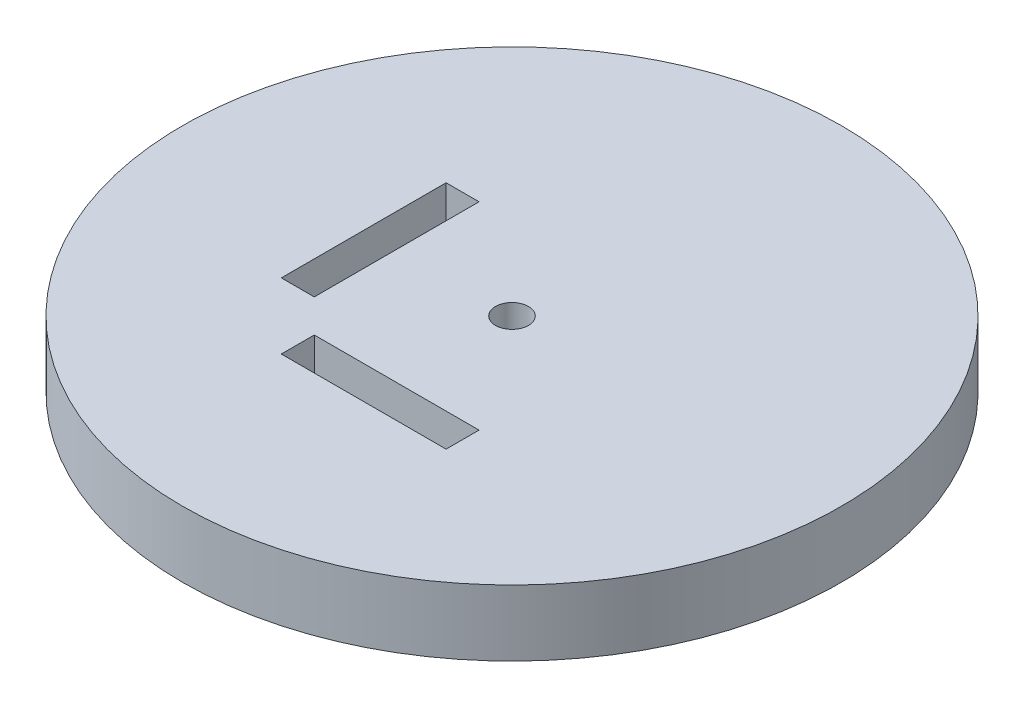
ISO-10303-21;
HEADER;
FILE_DESCRIPTION(('STEP AP214'),'2;1');
FILE_NAME('part.step','',(''),(''),'','','');
FILE_SCHEMA(('AUTOMOTIVE_DESIGN { 1 0 10303 214 1 1 1 1 }'));
ENDSEC;
DATA;
#1=APPLICATION_CONTEXT('core data for automotive mechanical design processes');
#2=APPLICATION_PROTOCOL_DEFINITION('international standard','automotive_design',2000,#1);
#3=PRODUCT_CONTEXT('',#1,'mechanical');
#4=PRODUCT('Part','Part','',(#3));
#5=PRODUCT_RELATED_PRODUCT_CATEGORY('part','',(#4));
#6=PRODUCT_DEFINITION_FORMATION('','',#4);
#7=PRODUCT_DEFINITION_CONTEXT('part definition',#1,'design');
#8=PRODUCT_DEFINITION('design','',#6,#7);
#9=PRODUCT_DEFINITION_SHAPE('','',#8);
#10=(LENGTH_UNIT() NAMED_UNIT(*) SI_UNIT(.MILLI.,.METRE.));
#11=(NAMED_UNIT(*) PLANE_ANGLE_UNIT() SI_UNIT($,.RADIAN.));
#12=(NAMED_UNIT(*) SI_UNIT($,.STERADIAN.) SOLID_ANGLE_UNIT());
#13=UNCERTAINTY_MEASURE_WITH_UNIT(LENGTH_MEASURE(1.E-05),#10,'distance_accuracy_value','');
#14=(GEOMETRIC_REPRESENTATION_CONTEXT(3) GLOBAL_UNCERTAINTY_ASSIGNED_CONTEXT((#13)) GLOBAL_UNIT_ASSIGNED_CONTEXT((#10,
#11,#12)) REPRESENTATION_CONTEXT('',''));
#15=CARTESIAN_POINT('',(0.,0.,0.));
#16=DIRECTION('',(0.,0.,1.));
#17=DIRECTION('',(1.,0.,0.));
#18=AXIS2_PLACEMENT_3D('',#15,#16,#17);
#19=CARTESIAN_POINT('',(0.,10.,0.));
#20=DIRECTION('',(0.,-1.,0.));
#21=DIRECTION('',(0.,0.,-1.));
#22=AXIS2_PLACEMENT_3D('',#19,#20,#21);
#23=CYLINDRICAL_SURFACE('',#22,50.);
#24=CARTESIAN_POINT('',(0.,10.,0.));
#25=DIRECTION('',(0.,1.,0.));
#26=DIRECTION('',(0.,0.,1.));
#27=AXIS2_PLACEMENT_3D('',#24,#25,#26);
#28=CIRCLE('',#27,50.);
#29=CARTESIAN_POINT('',(0.,10.,50.));
#30=VERTEX_POINT('',#29);
#31=EDGE_CURVE('E11',#30,#30,#28,.T.);
#32=ORIENTED_EDGE('',*,*,#31,.F.);
#33=EDGE_LOOP('',(#32));
#34=FACE_BOUND('',#33,.T.);
#35=CARTESIAN_POINT('',(0.,0.,0.));
#36=DIRECTION('',(0.,1.,0.));
#37=DIRECTION('',(0.,0.,1.));
#38=AXIS2_PLACEMENT_3D('',#35,#36,#37);
#39=CIRCLE('',#38,50.);
#40=CARTESIAN_POINT('',(0.,0.,50.));
#41=VERTEX_POINT('',#40);
#42=EDGE_CURVE('E36',#41,#41,#39,.T.);
#43=ORIENTED_EDGE('',*,*,#42,.T.);
#44=EDGE_LOOP('',(#43));
#45=FACE_BOUND('',#44,.T.);
#46=ADVANCED_FACE('F33',(#34,#45),#23,.T.);
#47=CARTESIAN_POINT('',(0.,10.,0.));
#48=DIRECTION('',(0.,1.,0.));
#49=DIRECTION('',(0.,0.,1.));
#50=AXIS2_PLACEMENT_3D('',#47,#48,#49);
#51=PLANE('',#50);
#52=DIRECTION('',(0.,0.,1.));
#53=VECTOR('',#52,1.);
#54=CARTESIAN_POINT('',(-22.5,10.,12.4999999999999));
#55=LINE('',#54,#53);
#56=CARTESIAN_POINT('',(-22.5,10.,-12.5000000000001));
#57=VERTEX_POINT('',#56);
#58=CARTESIAN_POINT('',(-22.5,10.,12.4999999999999));
#59=VERTEX_POINT('',#58);
#60=EDGE_CURVE('E47',#57,#59,#55,.T.);
#61=ORIENTED_EDGE('',*,*,#60,.F.);
#62=DIRECTION('',(-1.,0.,0.));
#63=VECTOR('',#62,1.);
#64=CARTESIAN_POINT('',(-17.5,10.,-12.5000000000001));
#65=LINE('',#64,#63);
#66=CARTESIAN_POINT('',(-17.5,10.,-12.5000000000001));
#67=VERTEX_POINT('',#66);
#68=EDGE_CURVE('E142',#67,#57,#65,.T.);
#69=ORIENTED_EDGE('',*,*,#68,.F.);
#70=DIRECTION('',(0.,0.,-1.));
#71=VECTOR('',#70,1.);
#72=CARTESIAN_POINT('',(-17.5,10.,12.4999999999999));
#73=LINE('',#72,#71);
#74=CARTESIAN_POINT('',(-17.5,10.,12.4999999999999));
#75=VERTEX_POINT('',#74);
#76=EDGE_CURVE('E156',#75,#67,#73,.T.);
#77=ORIENTED_EDGE('',*,*,#76,.F.);
#78=DIRECTION('',(1.,0.,0.));
#79=VECTOR('',#78,1.);
#80=CARTESIAN_POINT('',(-17.5,10.,12.4999999999999));
#81=LINE('',#80,#79);
#82=EDGE_CURVE('E153',#59,#75,#81,.T.);
#83=ORIENTED_EDGE('',*,*,#82,.F.);
#84=EDGE_LOOP('',(#61,#69,#77,#83));
#85=FACE_BOUND('',#84,.T.);
#86=DIRECTION('',(0.,0.,1.));
#87=VECTOR('',#86,1.);
#88=CARTESIAN_POINT('',(-12.5,10.,17.5));
#89=LINE('',#88,#87);
#90=CARTESIAN_POINT('',(-12.5,10.,17.5));
#91=VERTEX_POINT('',#90);
#92=CARTESIAN_POINT('',(-12.5,10.,22.5));
#93=VERTEX_POINT('',#92);
#94=EDGE_CURVE('E55',#91,#93,#89,.T.);
#95=ORIENTED_EDGE('',*,*,#94,.F.);
#96=DIRECTION('',(-1.,0.,0.));
#97=VECTOR('',#96,1.);
#98=CARTESIAN_POINT('',(12.5,10.,17.5));
#99=LINE('',#98,#97);
#100=CARTESIAN_POINT('',(12.5,10.,17.5));
#101=VERTEX_POINT('',#100);
#102=EDGE_CURVE('E118',#101,#91,#99,.T.);
#103=ORIENTED_EDGE('',*,*,#102,.F.);
#104=DIRECTION('',(0.,0.,-1.));
#105=VECTOR('',#104,1.);
#106=CARTESIAN_POINT('',(12.5,10.,17.5));
#107=LINE('',#106,#105);
#108=CARTESIAN_POINT('',(12.5,10.,22.5));
#109=VERTEX_POINT('',#108);
#110=EDGE_CURVE('E121',#109,#101,#107,.T.);
#111=ORIENTED_EDGE('',*,*,#110,.F.);
#112=DIRECTION('',(1.,0.,0.));
#113=VECTOR('',#112,1.);
#114=CARTESIAN_POINT('',(12.5,10.,22.5));
#115=LINE('',#114,#113);
#116=EDGE_CURVE('E127',#93,#109,#115,.T.);
#117=ORIENTED_EDGE('',*,*,#116,.F.);
#118=EDGE_LOOP('',(#95,#103,#111,#117));
#119=FACE_BOUND('',#118,.T.);
#120=CARTESIAN_POINT('',(0.,10.,0.));
#121=DIRECTION('',(0.,1.,0.));
#122=DIRECTION('',(0.,0.,1.));
#123=AXIS2_PLACEMENT_3D('',#120,#121,#122);
#124=CIRCLE('',#123,2.5);
#125=CARTESIAN_POINT('',(0.,10.,2.5));
#126=VERTEX_POINT('',#125);
#127=EDGE_CURVE('E134',#126,#126,#124,.T.);
#128=ORIENTED_EDGE('',*,*,#127,.F.);
#129=EDGE_LOOP('',(#128));
#130=FACE_BOUND('',#129,.T.);
#131=ORIENTED_EDGE('',*,*,#31,.T.);
#132=EDGE_LOOP('',(#131));
#133=FACE_BOUND('',#132,.T.);
#134=ADVANCED_FACE('F175',(#85,#119,#130,#133),#51,.T.);
#135=CARTESIAN_POINT('',(0.,0.,0.));
#136=DIRECTION('',(0.,1.,0.));
#137=DIRECTION('',(0.,0.,1.));
#138=AXIS2_PLACEMENT_3D('',#135,#136,#137);
#139=PLANE('',#138);
#140=DIRECTION('',(-1.,0.,0.));
#141=VECTOR('',#140,1.);
#142=CARTESIAN_POINT('',(-17.5,0.,-12.5000000000001));
#143=LINE('',#142,#141);
#144=CARTESIAN_POINT('',(-17.5,0.,-12.5000000000001));
#145=VERTEX_POINT('',#144);
#146=CARTESIAN_POINT('',(-22.5,0.,-12.5000000000001));
#147=VERTEX_POINT('',#146);
#148=EDGE_CURVE('E148',#145,#147,#143,.T.);
#149=ORIENTED_EDGE('',*,*,#148,.T.);
#150=DIRECTION('',(0.,0.,1.));
#151=VECTOR('',#150,1.);
#152=CARTESIAN_POINT('',(-22.5,0.,12.4999999999999));
#153=LINE('',#152,#151);
#154=CARTESIAN_POINT('',(-22.5,0.,12.4999999999999));
#155=VERTEX_POINT('',#154);
#156=EDGE_CURVE('E138',#147,#155,#153,.T.);
#157=ORIENTED_EDGE('',*,*,#156,.T.);
#158=DIRECTION('',(1.,0.,0.));
#159=VECTOR('',#158,1.);
#160=CARTESIAN_POINT('',(-17.5,0.,12.4999999999999));
#161=LINE('',#160,#159);
#162=CARTESIAN_POINT('',(-17.5,0.,12.4999999999999));
#163=VERTEX_POINT('',#162);
#164=EDGE_CURVE('E141',#155,#163,#161,.T.);
#165=ORIENTED_EDGE('',*,*,#164,.T.);
#166=DIRECTION('',(0.,0.,-1.));
#167=VECTOR('',#166,1.);
#168=CARTESIAN_POINT('',(-17.5,0.,12.4999999999999));
#169=LINE('',#168,#167);
#170=EDGE_CURVE('E145',#163,#145,#169,.T.);
#171=ORIENTED_EDGE('',*,*,#170,.T.);
#172=EDGE_LOOP('',(#149,#157,#165,#171));
#173=FACE_BOUND('',#172,.T.);
#174=DIRECTION('',(-1.,0.,0.));
#175=VECTOR('',#174,1.);
#176=CARTESIAN_POINT('',(12.5,0.,17.5));
#177=LINE('',#176,#175);
#178=CARTESIAN_POINT('',(12.5,0.,17.5));
#179=VERTEX_POINT('',#178);
#180=CARTESIAN_POINT('',(-12.5,0.,17.5));
#181=VERTEX_POINT('',#180);
#182=EDGE_CURVE('E105',#179,#181,#177,.T.);
#183=ORIENTED_EDGE('',*,*,#182,.T.);
#184=DIRECTION('',(0.,0.,1.));
#185=VECTOR('',#184,1.);
#186=CARTESIAN_POINT('',(-12.5,0.,17.5));
#187=LINE('',#186,#185);
#188=CARTESIAN_POINT('',(-12.5,0.,22.5));
#189=VERTEX_POINT('',#188);
#190=EDGE_CURVE('E99',#181,#189,#187,.T.);
#191=ORIENTED_EDGE('',*,*,#190,.T.);
#192=DIRECTION('',(1.,0.,0.));
#193=VECTOR('',#192,1.);
#194=CARTESIAN_POINT('',(12.5,0.,22.5));
#195=LINE('',#194,#193);
#196=CARTESIAN_POINT('',(12.5,0.,22.5));
#197=VERTEX_POINT('',#196);
#198=EDGE_CURVE('E109',#189,#197,#195,.T.);
#199=ORIENTED_EDGE('',*,*,#198,.T.);
#200=DIRECTION('',(0.,0.,-1.));
#201=VECTOR('',#200,1.);
#202=CARTESIAN_POINT('',(12.5,0.,17.5));
#203=LINE('',#202,#201);
#204=EDGE_CURVE('E113',#197,#179,#203,.T.);
#205=ORIENTED_EDGE('',*,*,#204,.T.);
#206=EDGE_LOOP('',(#183,#191,#199,#205));
#207=FACE_BOUND('',#206,.T.);
#208=CARTESIAN_POINT('',(0.,0.,0.));
#209=DIRECTION('',(0.,1.,0.));
#210=DIRECTION('',(0.,0.,1.));
#211=AXIS2_PLACEMENT_3D('',#208,#209,#210);
#212=CIRCLE('',#211,2.5);
#213=CARTESIAN_POINT('',(0.,0.,2.5));
#214=VERTEX_POINT('',#213);
#215=EDGE_CURVE('E167',#214,#214,#212,.T.);
#216=ORIENTED_EDGE('',*,*,#215,.T.);
#217=EDGE_LOOP('',(#216));
#218=FACE_BOUND('',#217,.T.);
#219=ORIENTED_EDGE('',*,*,#42,.F.);
#220=EDGE_LOOP('',(#219));
#221=FACE_BOUND('',#220,.T.);
#222=ADVANCED_FACE('F115',(#173,#207,#218,#221),#139,.F.);
#223=CARTESIAN_POINT('',(0.,0.,0.));
#224=DIRECTION('',(0.,1.,0.));
#225=DIRECTION('',(0.,0.,1.));
#226=AXIS2_PLACEMENT_3D('',#223,#224,#225);
#227=CYLINDRICAL_SURFACE('',#226,2.5);
#228=ORIENTED_EDGE('',*,*,#215,.F.);
#229=EDGE_LOOP('',(#228));
#230=FACE_BOUND('',#229,.T.);
#231=ORIENTED_EDGE('',*,*,#127,.T.);
#232=EDGE_LOOP('',(#231));
#233=FACE_BOUND('',#232,.T.);
#234=ADVANCED_FACE('F173',(#230,#233),#227,.F.);
#235=CARTESIAN_POINT('',(-12.5,0.,17.5));
#236=DIRECTION('',(-1.,0.,0.));
#237=DIRECTION('',(0.,0.,1.));
#238=AXIS2_PLACEMENT_3D('',#235,#236,#237);
#239=PLANE('',#238);
#240=ORIENTED_EDGE('',*,*,#94,.T.);
#241=DIRECTION('',(0.,1.,0.));
#242=VECTOR('',#241,1.);
#243=CARTESIAN_POINT('',(-12.5,0.,22.5));
#244=LINE('',#243,#242);
#245=EDGE_CURVE('E95',#189,#93,#244,.T.);
#246=ORIENTED_EDGE('',*,*,#245,.F.);
#247=ORIENTED_EDGE('',*,*,#190,.F.);
#248=DIRECTION('',(0.,1.,0.));
#249=VECTOR('',#248,1.);
#250=CARTESIAN_POINT('',(-12.5,0.,17.5));
#251=LINE('',#250,#249);
#252=EDGE_CURVE('E132',#181,#91,#251,.T.);
#253=ORIENTED_EDGE('',*,*,#252,.T.);
#254=EDGE_LOOP('',(#240,#246,#247,#253));
#255=FACE_BOUND('',#254,.T.);
#256=ADVANCED_FACE('F97',(#255),#239,.F.);
#257=CARTESIAN_POINT('',(12.5,0.,17.5));
#258=DIRECTION('',(0.,0.,-1.));
#259=DIRECTION('',(-1.,0.,0.));
#260=AXIS2_PLACEMENT_3D('',#257,#258,#259);
#261=PLANE('',#260);
#262=ORIENTED_EDGE('',*,*,#102,.T.);
#263=ORIENTED_EDGE('',*,*,#252,.F.);
#264=ORIENTED_EDGE('',*,*,#182,.F.);
#265=DIRECTION('',(0.,1.,0.));
#266=VECTOR('',#265,1.);
#267=CARTESIAN_POINT('',(12.5,0.,17.5));
#268=LINE('',#267,#266);
#269=EDGE_CURVE('E135',#179,#101,#268,.T.);
#270=ORIENTED_EDGE('',*,*,#269,.T.);
#271=EDGE_LOOP('',(#262,#263,#264,#270));
#272=FACE_BOUND('',#271,.T.);
#273=ADVANCED_FACE('F212',(#272),#261,.F.);
#274=CARTESIAN_POINT('',(12.5,0.,17.5));
#275=DIRECTION('',(1.,0.,0.));
#276=DIRECTION('',(0.,0.,-1.));
#277=AXIS2_PLACEMENT_3D('',#274,#275,#276);
#278=PLANE('',#277);
#279=ORIENTED_EDGE('',*,*,#110,.T.);
#280=ORIENTED_EDGE('',*,*,#269,.F.);
#281=ORIENTED_EDGE('',*,*,#204,.F.);
#282=DIRECTION('',(0.,1.,0.));
#283=VECTOR('',#282,1.);
#284=CARTESIAN_POINT('',(12.5,0.,22.5));
#285=LINE('',#284,#283);
#286=EDGE_CURVE('E104',#197,#109,#285,.T.);
#287=ORIENTED_EDGE('',*,*,#286,.T.);
#288=EDGE_LOOP('',(#279,#280,#281,#287));
#289=FACE_BOUND('',#288,.T.);
#290=ADVANCED_FACE('F215',(#289),#278,.F.);
#291=CARTESIAN_POINT('',(12.5,0.,22.5));
#292=DIRECTION('',(0.,0.,1.));
#293=DIRECTION('',(1.,0.,0.));
#294=AXIS2_PLACEMENT_3D('',#291,#292,#293);
#295=PLANE('',#294);
#296=ORIENTED_EDGE('',*,*,#116,.T.);
#297=ORIENTED_EDGE('',*,*,#286,.F.);
#298=ORIENTED_EDGE('',*,*,#198,.F.);
#299=ORIENTED_EDGE('',*,*,#245,.T.);
#300=EDGE_LOOP('',(#296,#297,#298,#299));
#301=FACE_BOUND('',#300,.T.);
#302=ADVANCED_FACE('F110',(#301),#295,.F.);
#303=CARTESIAN_POINT('',(-22.5,0.,12.4999999999999));
#304=DIRECTION('',(-1.,0.,0.));
#305=DIRECTION('',(0.,0.,1.));
#306=AXIS2_PLACEMENT_3D('',#303,#304,#305);
#307=PLANE('',#306);
#308=ORIENTED_EDGE('',*,*,#60,.T.);
#309=DIRECTION('',(0.,1.,0.));
#310=VECTOR('',#309,1.);
#311=CARTESIAN_POINT('',(-22.5,0.,12.4999999999999));
#312=LINE('',#311,#310);
#313=EDGE_CURVE('E151',#155,#59,#312,.T.);
#314=ORIENTED_EDGE('',*,*,#313,.F.);
#315=ORIENTED_EDGE('',*,*,#156,.F.);
#316=DIRECTION('',(0.,1.,0.));
#317=VECTOR('',#316,1.);
#318=CARTESIAN_POINT('',(-22.5,0.,-12.5000000000001));
#319=LINE('',#318,#317);
#320=EDGE_CURVE('E128',#147,#57,#319,.T.);
#321=ORIENTED_EDGE('',*,*,#320,.T.);
#322=EDGE_LOOP('',(#308,#314,#315,#321));
#323=FACE_BOUND('',#322,.T.);
#324=ADVANCED_FACE('F195',(#323),#307,.F.);
#325=CARTESIAN_POINT('',(-17.5,0.,-12.5000000000001));
#326=DIRECTION('',(0.,0.,-1.));
#327=DIRECTION('',(-1.,0.,0.));
#328=AXIS2_PLACEMENT_3D('',#325,#326,#327);
#329=PLANE('',#328);
#330=ORIENTED_EDGE('',*,*,#68,.T.);
#331=ORIENTED_EDGE('',*,*,#320,.F.);
#332=ORIENTED_EDGE('',*,*,#148,.F.);
#333=DIRECTION('',(0.,1.,0.));
#334=VECTOR('',#333,1.);
#335=CARTESIAN_POINT('',(-17.5,0.,-12.5000000000001));
#336=LINE('',#335,#334);
#337=EDGE_CURVE('E162',#145,#67,#336,.T.);
#338=ORIENTED_EDGE('',*,*,#337,.T.);
#339=EDGE_LOOP('',(#330,#331,#332,#338));
#340=FACE_BOUND('',#339,.T.);
#341=ADVANCED_FACE('F198',(#340),#329,.F.);
#342=CARTESIAN_POINT('',(-17.5,0.,12.4999999999999));
#343=DIRECTION('',(1.,0.,0.));
#344=DIRECTION('',(0.,0.,-1.));
#345=AXIS2_PLACEMENT_3D('',#342,#343,#344);
#346=PLANE('',#345);
#347=ORIENTED_EDGE('',*,*,#76,.T.);
#348=ORIENTED_EDGE('',*,*,#337,.F.);
#349=ORIENTED_EDGE('',*,*,#170,.F.);
#350=DIRECTION('',(0.,1.,0.));
#351=VECTOR('',#350,1.);
#352=CARTESIAN_POINT('',(-17.5,0.,12.4999999999999));
#353=LINE('',#352,#351);
#354=EDGE_CURVE('E164',#163,#75,#353,.T.);
#355=ORIENTED_EDGE('',*,*,#354,.T.);
#356=EDGE_LOOP('',(#347,#348,#349,#355));
#357=FACE_BOUND('',#356,.T.);
#358=ADVANCED_FACE('F202',(#357),#346,.F.);
#359=CARTESIAN_POINT('',(-17.5,0.,12.4999999999999));
#360=DIRECTION('',(0.,0.,1.));
#361=DIRECTION('',(1.,0.,0.));
#362=AXIS2_PLACEMENT_3D('',#359,#360,#361);
#363=PLANE('',#362);
#364=ORIENTED_EDGE('',*,*,#82,.T.);
#365=ORIENTED_EDGE('',*,*,#354,.F.);
#366=ORIENTED_EDGE('',*,*,#164,.F.);
#367=ORIENTED_EDGE('',*,*,#313,.T.);
#368=EDGE_LOOP('',(#364,#365,#366,#367));
#369=FACE_BOUND('',#368,.T.);
#370=ADVANCED_FACE('F199',(#369),#363,.F.);
#371=CLOSED_SHELL('',(#46,#134,#222,#234,#256,#273,#290,#302,#324,#341,#358,#370));
#372=MANIFOLD_SOLID_BREP('B2',#371);
#373=ADVANCED_BREP_SHAPE_REPRESENTATION('',(#18,#372),#14);
#374=SHAPE_DEFINITION_REPRESENTATION(#9,#373);
ENDSEC;
END-ISO-10303-21;
